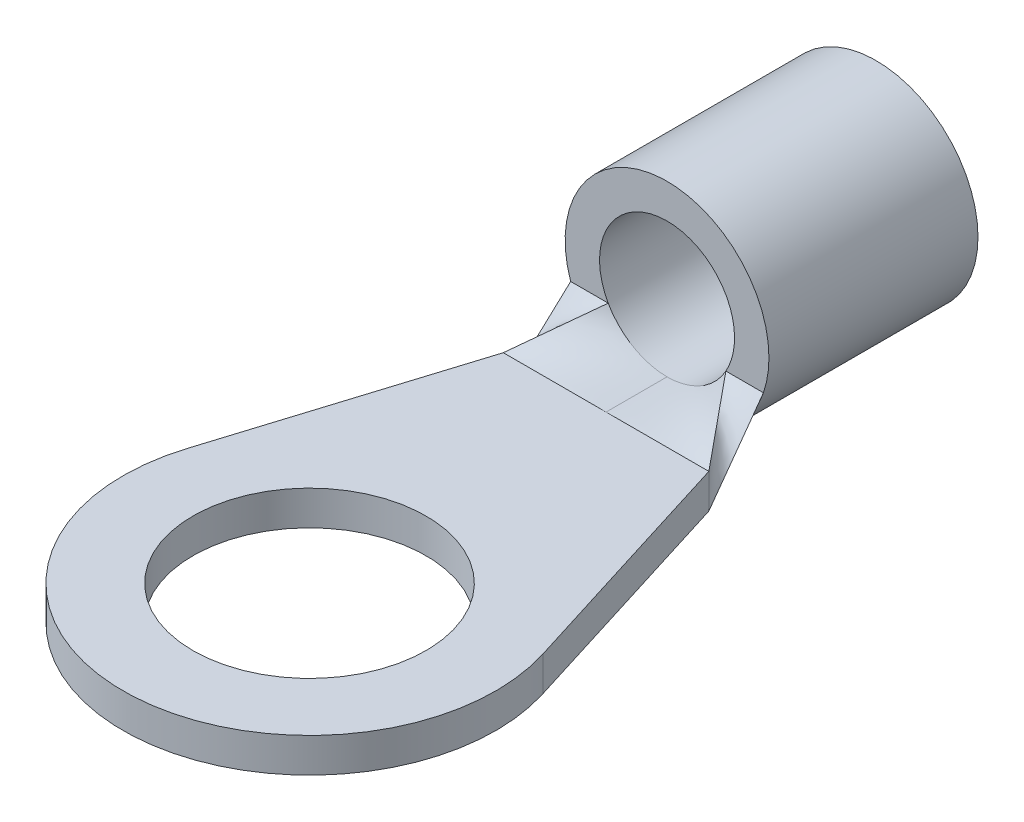
ISO-10303-21;
HEADER;
FILE_DESCRIPTION(('STEP AP214'),'2;1');
FILE_NAME('part.step','',(''),(''),'','','');
FILE_SCHEMA(('AUTOMOTIVE_DESIGN { 1 0 10303 214 1 1 1 1 }'));
ENDSEC;
DATA;
#1=APPLICATION_CONTEXT('core data for automotive mechanical design processes');
#2=APPLICATION_PROTOCOL_DEFINITION('international standard','automotive_design',2000,#1);
#3=PRODUCT_CONTEXT('',#1,'mechanical');
#4=PRODUCT('Part','Part','',(#3));
#5=PRODUCT_RELATED_PRODUCT_CATEGORY('part','',(#4));
#6=PRODUCT_DEFINITION_FORMATION('','',#4);
#7=PRODUCT_DEFINITION_CONTEXT('part definition',#1,'design');
#8=PRODUCT_DEFINITION('design','',#6,#7);
#9=PRODUCT_DEFINITION_SHAPE('','',#8);
#10=(LENGTH_UNIT() NAMED_UNIT(*) SI_UNIT(.MILLI.,.METRE.));
#11=(NAMED_UNIT(*) PLANE_ANGLE_UNIT() SI_UNIT($,.RADIAN.));
#12=(NAMED_UNIT(*) SI_UNIT($,.STERADIAN.) SOLID_ANGLE_UNIT());
#13=UNCERTAINTY_MEASURE_WITH_UNIT(LENGTH_MEASURE(1.E-05),#10,'distance_accuracy_value','');
#14=(GEOMETRIC_REPRESENTATION_CONTEXT(3) GLOBAL_UNCERTAINTY_ASSIGNED_CONTEXT((#13)) GLOBAL_UNIT_ASSIGNED_CONTEXT((#10,
#11,#12)) REPRESENTATION_CONTEXT('',''));
#15=CARTESIAN_POINT('',(0.,0.,0.));
#16=DIRECTION('',(0.,0.,1.));
#17=DIRECTION('',(1.,0.,0.));
#18=AXIS2_PLACEMENT_3D('',#15,#16,#17);
#19=CARTESIAN_POINT('',(0.,2.9718,-20.47354018104));
#20=DIRECTION('',(0.,0.,-1.));
#21=DIRECTION('',(0.,-1.,0.));
#22=AXIS2_PLACEMENT_3D('',#19,#20,#21);
#23=TOROIDAL_SURFACE('',#22,4.7371,2.7686);
#24=CARTESIAN_POINT('',(0.,2.9718,-20.47354018104));
#25=DIRECTION('',(0.,0.,1.));
#26=DIRECTION('',(1.,0.,0.));
#27=AXIS2_PLACEMENT_3D('',#24,#25,#26);
#28=CIRCLE('',#27,1.9685);
#29=CARTESIAN_POINT('',(1.9685,2.9718,-20.47354018104));
#30=VERTEX_POINT('',#29);
#31=EDGE_CURVE('E407',#30,#30,#28,.T.);
#32=ORIENTED_EDGE('',*,*,#31,.T.);
#33=EDGE_LOOP('',(#32));
#34=FACE_BOUND('',#33,.T.);
#35=CARTESIAN_POINT('',(0.,2.9718,-21.9583));
#36=DIRECTION('',(0.,0.,-1.));
#37=DIRECTION('',(-1.,0.,0.));
#38=AXIS2_PLACEMENT_3D('',#35,#36,#37);
#39=CIRCLE('',#38,2.4002999999996);
#40=CARTESIAN_POINT('',(-2.4002999999996,2.9718,-21.9583));
#41=VERTEX_POINT('',#40);
#42=EDGE_CURVE('E406',#41,#41,#39,.F.);
#43=ORIENTED_EDGE('',*,*,#42,.F.);
#44=EDGE_LOOP('',(#43));
#45=FACE_BOUND('',#44,.T.);
#46=ADVANCED_FACE('F43',(#34,#45),#23,.T.);
#47=CARTESIAN_POINT('',(0.,2.9718,-15.5575));
#48=DIRECTION('',(0.,0.,1.));
#49=DIRECTION('',(1.,0.,0.));
#50=AXIS2_PLACEMENT_3D('',#47,#48,#49);
#51=CYLINDRICAL_SURFACE('',#50,1.9685);
#52=ORIENTED_EDGE('',*,*,#31,.F.);
#53=EDGE_LOOP('',(#52));
#54=FACE_BOUND('',#53,.T.);
#55=CARTESIAN_POINT('',(1.73567280692567,2.04312774495081,-15.8622999999999));
#56=CARTESIAN_POINT('',(1.72912048872111,2.03088157255962,-15.8622999999999));
#57=CARTESIAN_POINT('',(1.55542623465408,1.71425828052444,-15.8622999999999));
#58=CARTESIAN_POINT('',(1.04117832760495,1.19140008908232,-15.8622999999999));
#59=CARTESIAN_POINT('',(0.333338600034629,0.999581116255773,-15.8622999999999));
#60=CARTESIAN_POINT('',(-0.0277778049131523,1.00344699680981,-15.8622999999999));
#61=CARTESIAN_POINT('',(-0.0416635961835322,1.00374095750298,-15.8622999999999));
#62=B_SPLINE_CURVE_WITH_KNOTS('',3,(#55,#56,#57,#58,#59,#60,#61),.UNSPECIFIED.,.F.,.F.,(4,1,1,1,
4),(-0.02,0.,0.5,1.,1.02),.UNSPECIFIED.);
#63=CARTESIAN_POINT('',(1.71562851748047,2.00660000000332,-15.8623000000008));
#64=VERTEX_POINT('',#63);
#65=CARTESIAN_POINT('',(0.,1.00329999999982,-15.8623));
#66=VERTEX_POINT('',#65);
#67=EDGE_CURVE('E241',#64,#66,#62,.T.);
#68=ORIENTED_EDGE('',*,*,#67,.F.);
#69=CARTESIAN_POINT('',(0.,2.9718,-15.8623));
#70=DIRECTION('',(0.,0.,1.));
#71=DIRECTION('',(1.,0.,0.));
#72=AXIS2_PLACEMENT_3D('',#69,#70,#71);
#73=CIRCLE('',#72,1.9685);
#74=CARTESIAN_POINT('',(-1.71562851748025,2.00660000000342,-15.8623000000009));
#75=VERTEX_POINT('',#74);
#76=EDGE_CURVE('E402',#64,#75,#73,.T.);
#77=ORIENTED_EDGE('',*,*,#76,.T.);
#78=CARTESIAN_POINT('',(0.0416635961835409,1.00374095750298,-15.8623));
#79=CARTESIAN_POINT('',(0.0277778049131612,1.00344699680981,-15.8623));
#80=CARTESIAN_POINT('',(-0.333338600034622,0.999581116255773,-15.8623));
#81=CARTESIAN_POINT('',(-1.04117832760493,1.19140008908233,-15.8623));
#82=CARTESIAN_POINT('',(-1.55542623465404,1.71425828052447,-15.8623));
#83=CARTESIAN_POINT('',(-1.72912048872105,2.03088157255967,-15.8623));
#84=CARTESIAN_POINT('',(-1.73567280692561,2.04312774495086,-15.8623));
#85=B_SPLINE_CURVE_WITH_KNOTS('',3,(#78,#79,#80,#81,#82,#83,#84),.UNSPECIFIED.,.F.,.F.,(4,1,1,1,
4),(-0.02,0.,0.5,1.,1.02),.UNSPECIFIED.);
#86=EDGE_CURVE('E240',#66,#75,#85,.T.);
#87=ORIENTED_EDGE('',*,*,#86,.F.);
#88=EDGE_LOOP('',(#68,#77,#87));
#89=FACE_BOUND('',#88,.T.);
#90=ADVANCED_FACE('F409',(#54,#89),#51,.F.);
#91=CARTESIAN_POINT('',(0.,2.9718,-15.8623));
#92=DIRECTION('',(0.,0.,-1.));
#93=DIRECTION('',(-1.,0.,0.));
#94=AXIS2_PLACEMENT_3D('',#91,#92,#93);
#95=PLANE('',#94);
#96=DIRECTION('',(-1.,-2.6112567753143E-11,0.));
#97=VECTOR('',#96,1.);
#98=CARTESIAN_POINT('',(-2.26315978564953,2.00660000000011,-15.8623000000003));
#99=LINE('',#98,#97);
#100=CARTESIAN_POINT('',(-2.81069105381626,2.00659999999977,-15.8623000000002));
#101=VERTEX_POINT('',#100);
#102=EDGE_CURVE('E198',#75,#101,#99,.T.);
#103=ORIENTED_EDGE('',*,*,#102,.F.);
#104=ORIENTED_EDGE('',*,*,#76,.F.);
#105=DIRECTION('',(-1.,2.6388266055217E-11,0.));
#106=VECTOR('',#105,1.);
#107=CARTESIAN_POINT('',(2.26315978564952,2.00659999999979,-15.8622999999999));
#108=LINE('',#107,#106);
#109=CARTESIAN_POINT('',(2.81069105381625,2.00659999999938,-15.8623));
#110=VERTEX_POINT('',#109);
#111=EDGE_CURVE('E229',#110,#64,#108,.T.);
#112=ORIENTED_EDGE('',*,*,#111,.F.);
#113=CARTESIAN_POINT('',(0.,2.9718,-15.8623));
#114=DIRECTION('',(0.,0.,1.));
#115=DIRECTION('',(1.,0.,0.));
#116=AXIS2_PLACEMENT_3D('',#113,#114,#115);
#117=CIRCLE('',#116,2.9718);
#118=EDGE_CURVE('E184',#101,#110,#117,.F.);
#119=ORIENTED_EDGE('',*,*,#118,.F.);
#120=EDGE_LOOP('',(#103,#104,#112,#119));
#121=FACE_BOUND('',#120,.T.);
#122=ADVANCED_FACE('F401',(#121),#95,.F.);
#123=CARTESIAN_POINT('',(0.,2.9718,-21.9583));
#124=DIRECTION('',(0.,0.,-1.));
#125=DIRECTION('',(-1.,0.,0.));
#126=AXIS2_PLACEMENT_3D('',#123,#124,#125);
#127=PLANE('',#126);
#128=ORIENTED_EDGE('',*,*,#42,.T.);
#129=EDGE_LOOP('',(#128));
#130=FACE_BOUND('',#129,.T.);
#131=CARTESIAN_POINT('',(0.,2.9718,-21.9583));
#132=DIRECTION('',(0.,0.,1.));
#133=DIRECTION('',(1.,0.,0.));
#134=AXIS2_PLACEMENT_3D('',#131,#132,#133);
#135=CIRCLE('',#134,2.9718);
#136=CARTESIAN_POINT('',(2.9718,2.9718,-21.9583));
#137=VERTEX_POINT('',#136);
#138=EDGE_CURVE('E178',#137,#137,#135,.T.);
#139=ORIENTED_EDGE('',*,*,#138,.F.);
#140=EDGE_LOOP('',(#139));
#141=FACE_BOUND('',#140,.T.);
#142=ADVANCED_FACE('F427',(#130,#141),#127,.T.);
#143=CARTESIAN_POINT('',(-0.06030960807633,1.00329118085,-14.04874));
#144=CARTESIAN_POINT('',(-0.05397240141995,1.003444046118,-14.66511333333));
#145=CARTESIAN_POINT('',(-0.04763519476358,1.003596911386,-15.28148666667));
#146=CARTESIAN_POINT('',(-0.0412979881072,1.003749776653,-15.89786));
#147=CARTESIAN_POINT('',(-0.04020636390174,1.003297060064,-14.04874));
#148=CARTESIAN_POINT('',(-0.03598227849385,1.003348018958,-14.66511333333));
#149=CARTESIAN_POINT('',(-0.03175819308597,1.003398977852,-15.28148666667));
#150=CARTESIAN_POINT('',(-0.02753410767808,1.003449936746,-15.89786));
#151=CARTESIAN_POINT('',(0.4824762679993,1.003374377675,-14.04874));
#152=CARTESIAN_POINT('',(0.4317889560113,1.002085164644,-14.66511333333));
#153=CARTESIAN_POINT('',(0.3811016440233,1.000795951612,-15.28148666667));
#154=CARTESIAN_POINT('',(0.3304143320353,0.9995067385809,-15.89786));
#155=CARTESIAN_POINT('',(1.507748433448,0.9995379982183,-14.04874));
#156=CARTESIAN_POINT('',(1.349175587017,1.0647460291,-14.66511333333));
#157=CARTESIAN_POINT('',(1.190602740587,1.129954059982,-15.28148666667));
#158=CARTESIAN_POINT('',(1.032029894157,1.195162090864,-15.89786));
#159=CARTESIAN_POINT('',(2.536892435307,0.9890808343895,-14.04874));
#160=CARTESIAN_POINT('',(2.20332222332,1.235546371638,-14.66511333333));
#161=CARTESIAN_POINT('',(1.869752011334,1.482011908887,-15.28148666667));
#162=CARTESIAN_POINT('',(1.536181799347,1.728477446135,-15.89786));
#163=CARTESIAN_POINT('',(3.063323510226,0.9827483685488,-14.04874));
#164=CARTESIAN_POINT('',(2.609868888538,1.338976647036,-14.66511333333));
#165=CARTESIAN_POINT('',(2.15641426685,1.695204925523,-15.28148666667));
#166=CARTESIAN_POINT('',(1.702959645162,2.051433204011,-15.89786));
#167=CARTESIAN_POINT('',(3.083573423861,0.982503445101,-14.04874));
#168=CARTESIAN_POINT('',(2.625463410262,1.342977063351,-14.66511333333));
#169=CARTESIAN_POINT('',(2.167353396663,1.7034506816,-15.28148666667));
#170=CARTESIAN_POINT('',(1.709243383064,2.06392429985,-15.89786));
#171=B_SPLINE_SURFACE_WITH_KNOTS('',3,3,((#143,#144,#145,#146),(#147,#148,#149,#150),(#151,#152,
#153,#154),(#155,#156,#157,#158),(#159,#160,#161,#162),(#163,#164,#165,#166),(#167,#168,#169,
#170)),.UNSPECIFIED.,.F.,.F.,.F.,(4,1,1,1,4),(4,4),(-0.02,0.,0.5,1.,1.02),(-0.02,1.02),.UNSPECIFIED.);
#172=DIRECTION('',(0.531670783971899,-0.416227502590126,0.737618359016567));
#173=VECTOR('',#172,1.);
#174=CARTESIAN_POINT('',(2.35641425874146,1.50494999999971,-14.9733));
#175=LINE('',#174,#173);
#176=CARTESIAN_POINT('',(2.99720000000075,1.00329999999958,-14.0843000000006));
#177=VERTEX_POINT('',#176);
#178=EDGE_CURVE('E211',#64,#177,#175,.T.);
#179=DIRECTION('',(0.,-2.66312963326112E-13,-1.));
#180=VECTOR('',#179,1.);
#181=CARTESIAN_POINT('',(0.,1.00329999999991,-14.9733));
#182=LINE('',#181,#180);
#183=CARTESIAN_POINT('',(0.,1.00330000000005,-14.0843));
#184=VERTEX_POINT('',#183);
#185=EDGE_CURVE('E237',#184,#66,#182,.T.);
#186=DIRECTION('',(1.,0.,0.));
#187=VECTOR('',#186,1.);
#188=CARTESIAN_POINT('',(0.,1.0033,-14.0843));
#189=LINE('',#188,#187);
#190=EDGE_CURVE('E183',#177,#184,#189,.F.);
#191=ORIENTED_EDGE('',*,*,#178,.F.);
#192=ORIENTED_EDGE('',*,*,#67,.T.);
#193=ORIENTED_EDGE('',*,*,#185,.F.);
#194=ORIENTED_EDGE('',*,*,#190,.F.);
#195=EDGE_LOOP('',(#191,#192,#193,#194));
#196=FACE_BOUND('',#195,.T.);
#197=ADVANCED_FACE('F267',(#196),#171,.T.);
#198=CARTESIAN_POINT('',(-3.083573423861,0.982503445101,-14.04874));
#199=CARTESIAN_POINT('',(-2.625463410262,1.342977063351,-14.66511333333));
#200=CARTESIAN_POINT('',(-2.167353396663,1.7034506816,-15.28148666667));
#201=CARTESIAN_POINT('',(-1.709243383064,2.06392429985,-15.89786));
#202=CARTESIAN_POINT('',(-3.063323510226,0.9827483685488,-14.04874));
#203=CARTESIAN_POINT('',(-2.609868888538,1.338976647036,-14.66511333333));
#204=CARTESIAN_POINT('',(-2.15641426685,1.695204925523,-15.28148666667));
#205=CARTESIAN_POINT('',(-1.702959645162,2.051433204011,-15.89786));
#206=CARTESIAN_POINT('',(-2.536892435307,0.9890808343895,-14.04874));
#207=CARTESIAN_POINT('',(-2.20332222332,1.235546371638,-14.66511333333));
#208=CARTESIAN_POINT('',(-1.869752011334,1.482011908887,-15.28148666667));
#209=CARTESIAN_POINT('',(-1.536181799347,1.728477446135,-15.89786));
#210=CARTESIAN_POINT('',(-1.507748433448,0.9995379982183,-14.04874));
#211=CARTESIAN_POINT('',(-1.349175587017,1.0647460291,-14.66511333333));
#212=CARTESIAN_POINT('',(-1.190602740587,1.129954059982,-15.28148666667));
#213=CARTESIAN_POINT('',(-1.032029894157,1.195162090864,-15.89786));
#214=CARTESIAN_POINT('',(-0.4824762679993,1.003374377675,-14.04874));
#215=CARTESIAN_POINT('',(-0.4317889560113,1.002085164644,-14.66511333333));
#216=CARTESIAN_POINT('',(-0.3811016440233,1.000795951612,-15.28148666667));
#217=CARTESIAN_POINT('',(-0.3304143320353,0.9995067385809,-15.89786));
#218=CARTESIAN_POINT('',(0.04020636390174,1.003297060064,-14.04874));
#219=CARTESIAN_POINT('',(0.03598227849385,1.003348018958,-14.66511333333));
#220=CARTESIAN_POINT('',(0.03175819308597,1.003398977852,-15.28148666667));
#221=CARTESIAN_POINT('',(0.02753410767809,1.003449936746,-15.89786));
#222=CARTESIAN_POINT('',(0.06030960807633,1.00329118085,-14.04874));
#223=CARTESIAN_POINT('',(0.05397240141996,1.003444046118,-14.66511333333));
#224=CARTESIAN_POINT('',(0.04763519476358,1.003596911386,-15.28148666667));
#225=CARTESIAN_POINT('',(0.04129798810721,1.003749776653,-15.89786));
#226=B_SPLINE_SURFACE_WITH_KNOTS('',3,3,((#198,#199,#200,#201),(#202,#203,#204,#205),(#206,#207,
#208,#209),(#210,#211,#212,#213),(#214,#215,#216,#217),(#218,#219,#220,#221),(#222,#223,#224,
#225)),.UNSPECIFIED.,.F.,.F.,.F.,(4,1,1,1,4),(4,4),(-0.02,0.,0.5,1.,1.02),(-0.02,1.02),.UNSPECIFIED.);
#227=DIRECTION('',(0.531670783972059,0.416227502589954,-0.737618359016548));
#228=VECTOR('',#227,1.);
#229=CARTESIAN_POINT('',(-2.35641425874125,1.5049499999999,-14.9733));
#230=LINE('',#229,#228);
#231=CARTESIAN_POINT('',(-2.99720000000051,1.00329999999967,-14.0843000000006));
#232=VERTEX_POINT('',#231);
#233=EDGE_CURVE('E226',#232,#75,#230,.T.);
#234=DIRECTION('',(1.,0.,0.));
#235=VECTOR('',#234,1.);
#236=CARTESIAN_POINT('',(0.,1.0033,-14.0843));
#237=LINE('',#236,#235);
#238=EDGE_CURVE('E219',#184,#232,#237,.F.);
#239=ORIENTED_EDGE('',*,*,#185,.T.);
#240=ORIENTED_EDGE('',*,*,#86,.T.);
#241=ORIENTED_EDGE('',*,*,#233,.F.);
#242=ORIENTED_EDGE('',*,*,#238,.F.);
#243=EDGE_LOOP('',(#239,#240,#241,#242));
#244=FACE_BOUND('',#243,.T.);
#245=ADVANCED_FACE('F254',(#244),#226,.T.);
#246=CARTESIAN_POINT('',(3.023492100984,1.014104774857,-14.04874));
#247=CARTESIAN_POINT('',(2.567762350591,1.351423413467,-14.66511333333));
#248=CARTESIAN_POINT('',(2.112032600198,1.688742052078,-15.28148666667));
#249=CARTESIAN_POINT('',(1.656302849805,2.026060690689,-15.89786));
#250=CARTESIAN_POINT('',(3.023271877206,1.003814516571,-14.04874));
#251=CARTESIAN_POINT('',(2.571359338964,1.344630497867,-14.66511333333));
#252=CARTESIAN_POINT('',(2.119446800723,1.685446479163,-15.28148666667));
#253=CARTESIAN_POINT('',(1.667534262481,2.026262460459,-15.89786));
#254=CARTESIAN_POINT('',(3.015751236519,0.6524022582855,-14.04874));
#255=CARTESIAN_POINT('',(2.694196470183,1.112652471156,-14.66511333333));
#256=CARTESIAN_POINT('',(2.372641703846,1.572902684026,-15.28148666667));
#257=CARTESIAN_POINT('',(2.05108693751,2.033152896896,-15.89786));
#258=CARTESIAN_POINT('',(3.008010372055,0.2906997417145,-14.04874));
#259=CARTESIAN_POINT('',(2.820630589775,0.8738815288442,-14.66511333333));
#260=CARTESIAN_POINT('',(2.633250807495,1.457063315974,-15.28148666667));
#261=CARTESIAN_POINT('',(2.445871025215,2.040245103104,-15.89786));
#262=CARTESIAN_POINT('',(3.000489731368,-0.06071251657109,-14.04874));
#263=CARTESIAN_POINT('',(2.943467720993,0.6419035021328,-14.66511333333));
#264=CARTESIAN_POINT('',(2.886445710618,1.344519520837,-15.28148666667));
#265=CARTESIAN_POINT('',(2.829423700244,2.047135539541,-15.89786));
#266=CARTESIAN_POINT('',(3.00026950759,-0.07100277485664,-14.04874));
#267=CARTESIAN_POINT('',(2.947064709366,0.6351105865325,-14.66511333333));
#268=CARTESIAN_POINT('',(2.893859911143,1.341223947922,-15.28148666667));
#269=CARTESIAN_POINT('',(2.84065511292,2.047337309311,-15.89786));
#270=B_SPLINE_SURFACE_WITH_KNOTS('',3,3,((#246,#247,#248,#249),(#250,#251,#252,#253),(#254,#255,
#256,#257),(#258,#259,#260,#261),(#262,#263,#264,#265),(#266,#267,#268,#269)),.UNSPECIFIED.,.F.,
.F.,.F.,(4,1,1,4),(4,4),(-0.03016591801627,0.,1.,1.030165918016),(-0.02,1.02),.UNSPECIFIED.);
#271=DIRECTION('',(0.0693993651602205,-0.746649257210498,0.661587949423483));
#272=VECTOR('',#271,1.);
#273=CARTESIAN_POINT('',(2.90394552690788,1.00329999999997,-14.9733));
#274=LINE('',#273,#272);
#275=CARTESIAN_POINT('',(2.9972,-5.9988906203623E-13,-14.0843000000007));
#276=VERTEX_POINT('',#275);
#277=EDGE_CURVE('E145',#110,#276,#274,.T.);
#278=DIRECTION('',(0.,1.,0.));
#279=VECTOR('',#278,1.);
#280=CARTESIAN_POINT('',(2.99720000000048,0.,-14.0843000000002));
#281=LINE('',#280,#279);
#282=EDGE_CURVE('E120',#276,#177,#281,.T.);
#283=ORIENTED_EDGE('',*,*,#277,.F.);
#284=ORIENTED_EDGE('',*,*,#111,.T.);
#285=ORIENTED_EDGE('',*,*,#178,.T.);
#286=ORIENTED_EDGE('',*,*,#282,.F.);
#287=EDGE_LOOP('',(#283,#284,#285,#286));
#288=FACE_BOUND('',#287,.T.);
#289=ADVANCED_FACE('F266',(#288),#270,.T.);
#290=CARTESIAN_POINT('',(-3.00026950759,-0.07100277485664,-14.04874));
#291=CARTESIAN_POINT('',(-2.947064709366,0.6351105865325,-14.66511333333));
#292=CARTESIAN_POINT('',(-2.893859911143,1.341223947922,-15.28148666667));
#293=CARTESIAN_POINT('',(-2.84065511292,2.047337309311,-15.89786));
#294=CARTESIAN_POINT('',(-3.000489731368,-0.06071251657109,-14.04874));
#295=CARTESIAN_POINT('',(-2.943467720993,0.6419035021328,-14.66511333333));
#296=CARTESIAN_POINT('',(-2.886445710618,1.344519520837,-15.28148666667));
#297=CARTESIAN_POINT('',(-2.829423700244,2.047135539541,-15.89786));
#298=CARTESIAN_POINT('',(-3.008010372055,0.2906997417145,-14.04874));
#299=CARTESIAN_POINT('',(-2.820630589775,0.8738815288442,-14.66511333333));
#300=CARTESIAN_POINT('',(-2.633250807495,1.457063315974,-15.28148666667));
#301=CARTESIAN_POINT('',(-2.445871025215,2.040245103104,-15.89786));
#302=CARTESIAN_POINT('',(-3.015751236519,0.6524022582855,-14.04874));
#303=CARTESIAN_POINT('',(-2.694196470183,1.112652471156,-14.66511333333));
#304=CARTESIAN_POINT('',(-2.372641703846,1.572902684026,-15.28148666667));
#305=CARTESIAN_POINT('',(-2.05108693751,2.033152896896,-15.89786));
#306=CARTESIAN_POINT('',(-3.023271877206,1.003814516571,-14.04874));
#307=CARTESIAN_POINT('',(-2.571359338964,1.344630497867,-14.66511333333));
#308=CARTESIAN_POINT('',(-2.119446800723,1.685446479163,-15.28148666667));
#309=CARTESIAN_POINT('',(-1.667534262481,2.026262460459,-15.89786));
#310=CARTESIAN_POINT('',(-3.023492100984,1.014104774857,-14.04874));
#311=CARTESIAN_POINT('',(-2.567762350591,1.351423413467,-14.66511333333));
#312=CARTESIAN_POINT('',(-2.112032600198,1.688742052078,-15.28148666667));
#313=CARTESIAN_POINT('',(-1.656302849805,2.026060690689,-15.89786));
#314=B_SPLINE_SURFACE_WITH_KNOTS('',3,3,((#290,#291,#292,#293),(#294,#295,#296,#297),(#298,#299,
#300,#301),(#302,#303,#304,#305),(#306,#307,#308,#309),(#310,#311,#312,#313)),.UNSPECIFIED.,.F.,
.F.,.F.,(4,1,1,4),(4,4),(-0.03016591801627,0.,1.,1.030165918016),(-0.02,1.02),.UNSPECIFIED.);
#315=DIRECTION('',(0.0693993651602916,0.746649257210564,-0.661587949423402));
#316=VECTOR('',#315,1.);
#317=CARTESIAN_POINT('',(-2.90394552690814,1.00330000000018,-14.9733));
#318=LINE('',#317,#316);
#319=CARTESIAN_POINT('',(-2.99719999999997,-5.95443833129039E-13,-14.0843000000007));
#320=VERTEX_POINT('',#319);
#321=EDGE_CURVE('E344',#320,#101,#318,.T.);
#322=DIRECTION('',(0.,1.,0.));
#323=VECTOR('',#322,1.);
#324=CARTESIAN_POINT('',(-2.9972,0.,-14.0843));
#325=LINE('',#324,#323);
#326=EDGE_CURVE('E135',#232,#320,#325,.F.);
#327=ORIENTED_EDGE('',*,*,#233,.T.);
#328=ORIENTED_EDGE('',*,*,#102,.T.);
#329=ORIENTED_EDGE('',*,*,#321,.F.);
#330=ORIENTED_EDGE('',*,*,#326,.F.);
#331=EDGE_LOOP('',(#327,#328,#329,#330));
#332=FACE_BOUND('',#331,.T.);
#333=ADVANCED_FACE('F281',(#332),#314,.T.);
#334=CARTESIAN_POINT('',(0.,2.9718,-15.5575));
#335=DIRECTION('',(0.,0.,1.));
#336=DIRECTION('',(1.,0.,0.));
#337=AXIS2_PLACEMENT_3D('',#334,#335,#336);
#338=CYLINDRICAL_SURFACE('',#337,2.9718);
#339=CARTESIAN_POINT('',(-0.0736937111272338,0.000913856617810988,-15.8623));
#340=CARTESIAN_POINT('',(-0.0491341771079927,0.000304650098919284,-15.8623));
#341=CARTESIAN_POINT('',(0.589627276546164,-0.00774236493291001,-15.8623));
#342=CARTESIAN_POINT('',(1.84083300811075,0.393302607661137,-15.8623));
#343=CARTESIAN_POINT('',(2.62651080902453,1.4464233252881,-15.8623));
#344=CARTESIAN_POINT('',(2.82636102838954,2.05316943277135,-15.8623));
#345=CARTESIAN_POINT('',(2.83376144932058,2.07659539302625,-15.8623));
#346=B_SPLINE_CURVE_WITH_KNOTS('',3,(#339,#340,#341,#342,#343,#344,#345),.UNSPECIFIED.,.F.,.F.,
(4,1,1,1,4),(-0.02,0.,0.5,1.,1.02),.UNSPECIFIED.);
#347=CARTESIAN_POINT('',(0.,0.,-15.8623000000001));
#348=VERTEX_POINT('',#347);
#349=EDGE_CURVE('E161',#348,#110,#346,.T.);
#350=ORIENTED_EDGE('',*,*,#349,.F.);
#351=CARTESIAN_POINT('',(-2.83376144932048,2.07659539302718,-15.8623000000008));
#352=CARTESIAN_POINT('',(-2.82636102838945,2.05316943277227,-15.8623000000008));
#353=CARTESIAN_POINT('',(-2.62651080902457,1.44642332528875,-15.8623000000008));
#354=CARTESIAN_POINT('',(-1.84083300811091,0.393302607661313,-15.8623000000008));
#355=CARTESIAN_POINT('',(-0.589627276546213,-0.00774236493291253,-15.8623000000008));
#356=CARTESIAN_POINT('',(0.0491341771079968,0.000304650098919421,-15.8623000000008));
#357=CARTESIAN_POINT('',(0.0736937111272399,0.000913856617811397,-15.8623000000008));
#358=B_SPLINE_CURVE_WITH_KNOTS('',3,(#351,#352,#353,#354,#355,#356,#357),.UNSPECIFIED.,.F.,.F.,
(4,1,1,1,4),(-0.02,0.,0.5,1.,1.02),.UNSPECIFIED.);
#359=EDGE_CURVE('E340',#101,#348,#358,.T.);
#360=ORIENTED_EDGE('',*,*,#359,.F.);
#361=ORIENTED_EDGE('',*,*,#118,.T.);
#362=EDGE_LOOP('',(#350,#360,#361));
#363=FACE_BOUND('',#362,.T.);
#364=ORIENTED_EDGE('',*,*,#138,.T.);
#365=EDGE_LOOP('',(#364));
#366=FACE_BOUND('',#365,.T.);
#367=ADVANCED_FACE('F291',(#363,#366),#338,.T.);
#368=CARTESIAN_POINT('',(0.,1.0033,0.));
#369=DIRECTION('',(0.,1.,0.));
#370=DIRECTION('',(0.,0.,1.));
#371=AXIS2_PLACEMENT_3D('',#368,#369,#370);
#372=PLANE('',#371);
#373=CARTESIAN_POINT('',(0.,1.0033,-5.4356));
#374=DIRECTION('',(0.,1.,0.));
#375=DIRECTION('',(0.,0.,1.));
#376=AXIS2_PLACEMENT_3D('',#373,#374,#375);
#377=CIRCLE('',#376,3.4);
#378=CARTESIAN_POINT('',(0.,1.0033,-2.0356));
#379=VERTEX_POINT('',#378);
#380=EDGE_CURVE('E507',#379,#379,#377,.T.);
#381=ORIENTED_EDGE('',*,*,#380,.F.);
#382=EDGE_LOOP('',(#381));
#383=FACE_BOUND('',#382,.T.);
#384=CARTESIAN_POINT('',(0.,1.0033,-5.4356));
#385=DIRECTION('',(0.,-1.,0.));
#386=DIRECTION('',(0.,0.,-1.));
#387=AXIS2_PLACEMENT_3D('',#384,#385,#386);
#388=CIRCLE('',#387,5.4356);
#389=CARTESIAN_POINT('',(5.18924004949497,1.0033,-7.0534798066361));
#390=VERTEX_POINT('',#389);
#391=CARTESIAN_POINT('',(-5.18924004949458,1.0033,-7.05347980663597));
#392=VERTEX_POINT('',#391);
#393=EDGE_CURVE('E127',#390,#392,#388,.T.);
#394=ORIENTED_EDGE('',*,*,#393,.F.);
#395=DIRECTION('',(-0.297645118595205,0.,-0.954676585748517));
#396=VECTOR('',#395,1.);
#397=CARTESIAN_POINT('',(5.189240049495,1.0033,-7.053479806636));
#398=LINE('',#397,#396);
#399=EDGE_CURVE('E112',#177,#390,#398,.F.);
#400=ORIENTED_EDGE('',*,*,#399,.F.);
#401=ORIENTED_EDGE('',*,*,#190,.T.);
#402=ORIENTED_EDGE('',*,*,#238,.T.);
#403=DIRECTION('',(-0.297645118595205,0.,0.954676585748517));
#404=VECTOR('',#403,1.);
#405=CARTESIAN_POINT('',(-2.9972,1.0033,-14.0843));
#406=LINE('',#405,#404);
#407=EDGE_CURVE('E131',#392,#232,#406,.F.);
#408=ORIENTED_EDGE('',*,*,#407,.F.);
#409=EDGE_LOOP('',(#394,#400,#401,#402,#408));
#410=FACE_BOUND('',#409,.T.);
#411=ADVANCED_FACE('F128',(#383,#410),#372,.T.);
#412=CARTESIAN_POINT('',(-2.9972,0.,-14.0843));
#413=DIRECTION('',(-0.954676585748517,0.,-0.297645118595205));
#414=DIRECTION('',(-0.297645118595205,0.,0.954676585748517));
#415=AXIS2_PLACEMENT_3D('',#412,#413,#414);
#416=PLANE('',#415);
#417=ORIENTED_EDGE('',*,*,#407,.T.);
#418=ORIENTED_EDGE('',*,*,#326,.T.);
#419=DIRECTION('',(-0.297645118595271,0.,0.954676585748497));
#420=VECTOR('',#419,1.);
#421=CARTESIAN_POINT('',(-2.9972,0.,-14.0843));
#422=LINE('',#421,#420);
#423=CARTESIAN_POINT('',(-5.18924004949477,0.,-7.05347980663623));
#424=VERTEX_POINT('',#423);
#425=EDGE_CURVE('E343',#320,#424,#422,.T.);
#426=ORIENTED_EDGE('',*,*,#425,.T.);
#427=DIRECTION('',(0.,-1.,0.));
#428=VECTOR('',#427,1.);
#429=CARTESIAN_POINT('',(-5.1892400494947,0.,-7.05347980663591));
#430=LINE('',#429,#428);
#431=EDGE_CURVE('E123',#392,#424,#430,.T.);
#432=ORIENTED_EDGE('',*,*,#431,.F.);
#433=EDGE_LOOP('',(#417,#418,#426,#432));
#434=FACE_BOUND('',#433,.T.);
#435=ADVANCED_FACE('F391',(#434),#416,.T.);
#436=CARTESIAN_POINT('',(0.,0.,-5.4356));
#437=DIRECTION('',(0.,-1.,0.));
#438=DIRECTION('',(0.,0.,-1.));
#439=AXIS2_PLACEMENT_3D('',#436,#437,#438);
#440=CYLINDRICAL_SURFACE('',#439,5.4356);
#441=ORIENTED_EDGE('',*,*,#431,.T.);
#442=CARTESIAN_POINT('',(0.,0.,-5.4356));
#443=DIRECTION('',(0.,-1.,0.));
#444=DIRECTION('',(0.,0.,-1.));
#445=AXIS2_PLACEMENT_3D('',#442,#443,#444);
#446=CIRCLE('',#445,5.4356);
#447=CARTESIAN_POINT('',(5.18924004949491,0.,-7.05347980663627));
#448=VERTEX_POINT('',#447);
#449=EDGE_CURVE('E140',#424,#448,#446,.F.);
#450=ORIENTED_EDGE('',*,*,#449,.T.);
#451=DIRECTION('',(0.,1.,0.));
#452=VECTOR('',#451,1.);
#453=CARTESIAN_POINT('',(5.189240049495,0.,-7.053479806636));
#454=LINE('',#453,#452);
#455=EDGE_CURVE('E117',#390,#448,#454,.F.);
#456=ORIENTED_EDGE('',*,*,#455,.F.);
#457=ORIENTED_EDGE('',*,*,#393,.T.);
#458=EDGE_LOOP('',(#441,#450,#456,#457));
#459=FACE_BOUND('',#458,.T.);
#460=ADVANCED_FACE('F138',(#459),#440,.T.);
#461=CARTESIAN_POINT('',(5.189240049495,0.,-7.053479806636));
#462=DIRECTION('',(0.954676585748517,0.,-0.297645118595205));
#463=DIRECTION('',(-0.297645118595205,0.,-0.954676585748517));
#464=AXIS2_PLACEMENT_3D('',#461,#462,#463);
#465=PLANE('',#464);
#466=DIRECTION('',(-0.297645118595271,0.,-0.954676585748497));
#467=VECTOR('',#466,1.);
#468=CARTESIAN_POINT('',(5.189240049495,0.,-7.053479806636));
#469=LINE('',#468,#467);
#470=EDGE_CURVE('E156',#448,#276,#469,.T.);
#471=ORIENTED_EDGE('',*,*,#470,.T.);
#472=ORIENTED_EDGE('',*,*,#282,.T.);
#473=ORIENTED_EDGE('',*,*,#399,.T.);
#474=ORIENTED_EDGE('',*,*,#455,.T.);
#475=EDGE_LOOP('',(#471,#472,#473,#474));
#476=FACE_BOUND('',#475,.T.);
#477=ADVANCED_FACE('F115',(#476),#465,.T.);
#478=CARTESIAN_POINT('',(3.061611651014,-0.04153190786052,-14.04874));
#479=CARTESIAN_POINT('',(2.984172366778,0.6783544950552,-14.66511333333));
#480=CARTESIAN_POINT('',(2.906733082542,1.398240897971,-15.28148666667));
#481=CARTESIAN_POINT('',(2.829293798307,2.118127300887,-15.89786));
#482=CARTESIAN_POINT('',(3.041378699432,-0.04106338865542,-14.04874));
#483=CARTESIAN_POINT('',(2.968300798163,0.6707020147053,-14.66511333333));
#484=CARTESIAN_POINT('',(2.895222896893,1.382467418066,-15.28148666667));
#485=CARTESIAN_POINT('',(2.822144995624,2.094232821427,-15.89786));
#486=CARTESIAN_POINT('',(2.51547074382,-0.02892846650577,-14.04874));
#487=CARTESIAN_POINT('',(2.553209850948,0.4724982862609,-14.66511333333));
#488=CARTESIAN_POINT('',(2.590948958077,0.9739250390277,-15.28148666667));
#489=CARTESIAN_POINT('',(2.628688065205,1.475351791794,-15.89786));
#490=CARTESIAN_POINT('',(1.491755339838,-0.007866052153224,-14.04874));
#491=CARTESIAN_POINT('',(1.610396115983,0.128478851836,-14.66511333333));
#492=CARTESIAN_POINT('',(1.729036892128,0.2648237558252,-15.28148666667));
#493=CARTESIAN_POINT('',(1.847677668273,0.4011686598144,-15.89786));
#494=CARTESIAN_POINT('',(0.4773504944691,0.0001548472986582,-14.04874));
#495=CARTESIAN_POINT('',(0.5155099236718,-0.002529172544751,-14.66511333333));
#496=CARTESIAN_POINT('',(0.5536693528744,-0.00521319238816,-15.28148666667));
#497=CARTESIAN_POINT('',(0.5918287820771,-0.007897212231569,-15.89786));
#498=CARTESIAN_POINT('',(-0.03977923645784,-6.093001978386E-06,-14.04874));
#499=CARTESIAN_POINT('',(-0.04295869341083,9.951903231364E-05,-14.66511333333));
#500=CARTESIAN_POINT('',(-0.04613815036383,0.0002051310666057,-15.28148666667));
#501=CARTESIAN_POINT('',(-0.04931760731682,0.0003107431008977,-15.89786));
#502=CARTESIAN_POINT('',(-0.05966900577746,-1.827713235622E-05,-14.04874));
#503=CARTESIAN_POINT('',(-0.06443557230156,0.0002985264951516,-14.66511333333));
#504=CARTESIAN_POINT('',(-0.06920213882567,0.0006153301226595,-15.28148666667));
#505=CARTESIAN_POINT('',(-0.07396870534978,0.0009321337501673,-15.89786));
#506=B_SPLINE_SURFACE_WITH_KNOTS('',3,3,((#478,#479,#480,#481),(#482,#483,#484,#485),(#486,#487,
#488,#489),(#490,#491,#492,#493),(#494,#495,#496,#497),(#498,#499,#500,#501),(#502,#503,#504,
#505)),.UNSPECIFIED.,.F.,.F.,.F.,(4,1,1,1,4),(4,4),(-0.02,0.,0.5,1.,1.02),(-0.02,1.02),.UNSPECIFIED.);
#507=DIRECTION('',(0.,0.,1.));
#508=VECTOR('',#507,1.);
#509=CARTESIAN_POINT('',(0.,0.,-14.9733));
#510=LINE('',#509,#508);
#511=CARTESIAN_POINT('',(0.,0.,-14.0843));
#512=VERTEX_POINT('',#511);
#513=EDGE_CURVE('E67',#348,#512,#510,.T.);
#514=DIRECTION('',(1.,0.,0.));
#515=VECTOR('',#514,1.);
#516=CARTESIAN_POINT('',(0.,0.,-14.0843));
#517=LINE('',#516,#515);
#518=EDGE_CURVE('E59',#276,#512,#517,.F.);
#519=ORIENTED_EDGE('',*,*,#513,.F.);
#520=ORIENTED_EDGE('',*,*,#349,.T.);
#521=ORIENTED_EDGE('',*,*,#277,.T.);
#522=ORIENTED_EDGE('',*,*,#518,.T.);
#523=EDGE_LOOP('',(#519,#520,#521,#522));
#524=FACE_BOUND('',#523,.T.);
#525=ADVANCED_FACE('F293',(#524),#506,.T.);
#526=CARTESIAN_POINT('',(0.05966900577746,-1.827713235622E-05,-14.04874));
#527=CARTESIAN_POINT('',(0.06443557230156,0.0002985264951516,-14.66511333333));
#528=CARTESIAN_POINT('',(0.06920213882567,0.0006153301226595,-15.28148666667));
#529=CARTESIAN_POINT('',(0.07396870534978,0.0009321337501673,-15.89786));
#530=CARTESIAN_POINT('',(0.03977923645784,-6.093001978386E-06,-14.04874));
#531=CARTESIAN_POINT('',(0.04295869341083,9.951903231363E-05,-14.66511333333));
#532=CARTESIAN_POINT('',(0.04613815036383,0.0002051310666057,-15.28148666667));
#533=CARTESIAN_POINT('',(0.04931760731682,0.0003107431008977,-15.89786));
#534=CARTESIAN_POINT('',(-0.4773504944691,0.0001548472986582,-14.04874));
#535=CARTESIAN_POINT('',(-0.5155099236718,-0.002529172544751,-14.66511333333));
#536=CARTESIAN_POINT('',(-0.5536693528744,-0.00521319238816,-15.28148666667));
#537=CARTESIAN_POINT('',(-0.5918287820771,-0.007897212231568,-15.89786));
#538=CARTESIAN_POINT('',(-1.491755339838,-0.007866052153224,-14.04874));
#539=CARTESIAN_POINT('',(-1.610396115983,0.128478851836,-14.66511333333));
#540=CARTESIAN_POINT('',(-1.729036892128,0.2648237558252,-15.28148666667));
#541=CARTESIAN_POINT('',(-1.847677668273,0.4011686598144,-15.89786));
#542=CARTESIAN_POINT('',(-2.51547074382,-0.02892846650577,-14.04874));
#543=CARTESIAN_POINT('',(-2.553209850948,0.4724982862609,-14.66511333333));
#544=CARTESIAN_POINT('',(-2.590948958077,0.9739250390276,-15.28148666667));
#545=CARTESIAN_POINT('',(-2.628688065205,1.475351791794,-15.89786));
#546=CARTESIAN_POINT('',(-3.041378699432,-0.04106338865542,-14.04874));
#547=CARTESIAN_POINT('',(-2.968300798163,0.6707020147053,-14.66511333333));
#548=CARTESIAN_POINT('',(-2.895222896893,1.382467418066,-15.28148666667));
#549=CARTESIAN_POINT('',(-2.822144995624,2.094232821427,-15.89786));
#550=CARTESIAN_POINT('',(-3.061611651014,-0.04153190786052,-14.04874));
#551=CARTESIAN_POINT('',(-2.984172366778,0.6783544950552,-14.66511333333));
#552=CARTESIAN_POINT('',(-2.906733082542,1.398240897971,-15.28148666667));
#553=CARTESIAN_POINT('',(-2.829293798307,2.118127300887,-15.89786));
#554=B_SPLINE_SURFACE_WITH_KNOTS('',3,3,((#526,#527,#528,#529),(#530,#531,#532,#533),(#534,#535,
#536,#537),(#538,#539,#540,#541),(#542,#543,#544,#545),(#546,#547,#548,#549),(#550,#551,#552,
#553)),.UNSPECIFIED.,.F.,.F.,.F.,(4,1,1,1,4),(4,4),(-0.02,0.,0.5,1.,1.02),(-0.02,1.02),.UNSPECIFIED.);
#555=DIRECTION('',(1.,0.,0.));
#556=VECTOR('',#555,1.);
#557=CARTESIAN_POINT('',(0.,0.,-14.0843));
#558=LINE('',#557,#556);
#559=EDGE_CURVE('E12',#512,#320,#558,.F.);
#560=ORIENTED_EDGE('',*,*,#321,.T.);
#561=ORIENTED_EDGE('',*,*,#359,.T.);
#562=ORIENTED_EDGE('',*,*,#513,.T.);
#563=ORIENTED_EDGE('',*,*,#559,.T.);
#564=EDGE_LOOP('',(#560,#561,#562,#563));
#565=FACE_BOUND('',#564,.T.);
#566=ADVANCED_FACE('F45',(#565),#554,.T.);
#567=CARTESIAN_POINT('',(0.,0.,0.));
#568=DIRECTION('',(0.,1.,0.));
#569=DIRECTION('',(0.,0.,1.));
#570=AXIS2_PLACEMENT_3D('',#567,#568,#569);
#571=PLANE('',#570);
#572=CARTESIAN_POINT('',(0.,0.,-5.4356));
#573=DIRECTION('',(0.,1.,0.));
#574=DIRECTION('',(0.,0.,1.));
#575=AXIS2_PLACEMENT_3D('',#572,#573,#574);
#576=CIRCLE('',#575,3.4);
#577=CARTESIAN_POINT('',(0.,0.,-2.0356));
#578=VERTEX_POINT('',#577);
#579=EDGE_CURVE('E385',#578,#578,#576,.T.);
#580=ORIENTED_EDGE('',*,*,#579,.T.);
#581=EDGE_LOOP('',(#580));
#582=FACE_BOUND('',#581,.T.);
#583=ORIENTED_EDGE('',*,*,#518,.F.);
#584=ORIENTED_EDGE('',*,*,#470,.F.);
#585=ORIENTED_EDGE('',*,*,#449,.F.);
#586=ORIENTED_EDGE('',*,*,#425,.F.);
#587=ORIENTED_EDGE('',*,*,#559,.F.);
#588=EDGE_LOOP('',(#583,#584,#585,#586,#587));
#589=FACE_BOUND('',#588,.T.);
#590=ADVANCED_FACE('F379',(#582,#589),#571,.F.);
#591=CARTESIAN_POINT('',(0.,1.0033,-5.4356));
#592=DIRECTION('',(0.,1.,0.));
#593=DIRECTION('',(0.,0.,1.));
#594=AXIS2_PLACEMENT_3D('',#591,#592,#593);
#595=CYLINDRICAL_SURFACE('',#594,3.4);
#596=ORIENTED_EDGE('',*,*,#380,.T.);
#597=EDGE_LOOP('',(#596));
#598=FACE_BOUND('',#597,.T.);
#599=ORIENTED_EDGE('',*,*,#579,.F.);
#600=EDGE_LOOP('',(#599));
#601=FACE_BOUND('',#600,.T.);
#602=ADVANCED_FACE('F481',(#598,#601),#595,.F.);
#603=CLOSED_SHELL('',(#46,#90,#122,#142,#197,#245,#289,#333,#367,#411,#435,#460,#477,#525,#566,
#590,#602));
#604=MANIFOLD_SOLID_BREP('B2',#603);
#605=ADVANCED_BREP_SHAPE_REPRESENTATION('',(#18,#604),#14);
#606=SHAPE_DEFINITION_REPRESENTATION(#9,#605);
ENDSEC;
END-ISO-10303-21;
